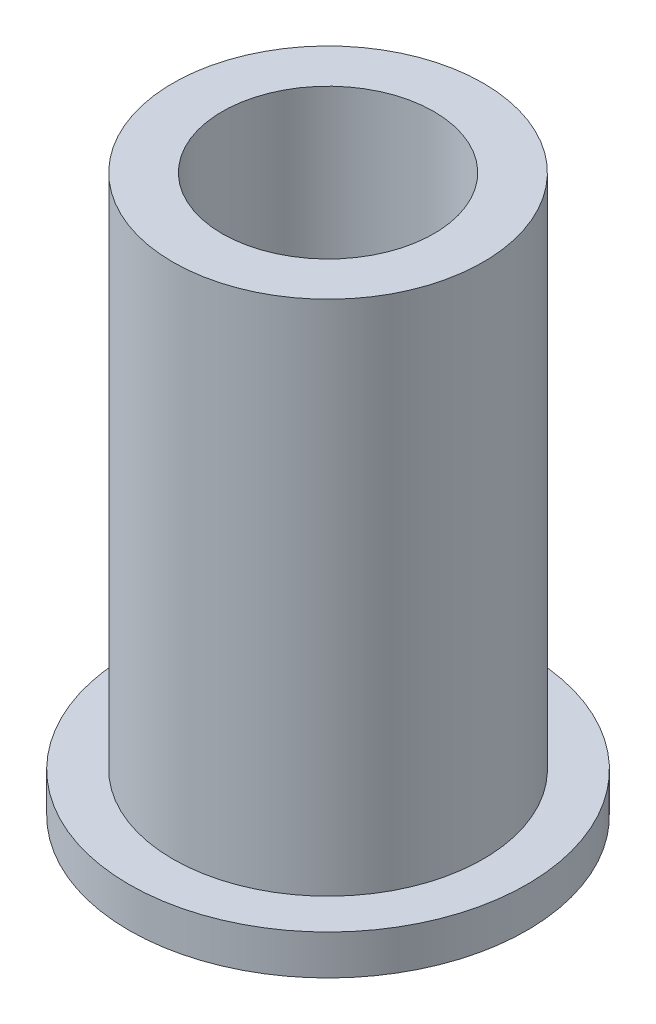
ISO-10303-21;
HEADER;
FILE_DESCRIPTION(('STEP AP214'),'2;1');
FILE_NAME('part.step','',(''),(''),'','','');
FILE_SCHEMA(('AUTOMOTIVE_DESIGN { 1 0 10303 214 1 1 1 1 }'));
ENDSEC;
DATA;
#1=APPLICATION_CONTEXT('core data for automotive mechanical design processes');
#2=APPLICATION_PROTOCOL_DEFINITION('international standard','automotive_design',2000,#1);
#3=PRODUCT_CONTEXT('',#1,'mechanical');
#4=PRODUCT('Part','Part','',(#3));
#5=PRODUCT_RELATED_PRODUCT_CATEGORY('part','',(#4));
#6=PRODUCT_DEFINITION_FORMATION('','',#4);
#7=PRODUCT_DEFINITION_CONTEXT('part definition',#1,'design');
#8=PRODUCT_DEFINITION('design','',#6,#7);
#9=PRODUCT_DEFINITION_SHAPE('','',#8);
#10=(LENGTH_UNIT() NAMED_UNIT(*) SI_UNIT(.MILLI.,.METRE.));
#11=(NAMED_UNIT(*) PLANE_ANGLE_UNIT() SI_UNIT($,.RADIAN.));
#12=(NAMED_UNIT(*) SI_UNIT($,.STERADIAN.) SOLID_ANGLE_UNIT());
#13=UNCERTAINTY_MEASURE_WITH_UNIT(LENGTH_MEASURE(1.E-05),#10,'distance_accuracy_value','');
#14=(GEOMETRIC_REPRESENTATION_CONTEXT(3) GLOBAL_UNCERTAINTY_ASSIGNED_CONTEXT((#13)) GLOBAL_UNIT_ASSIGNED_CONTEXT((#10,
#11,#12)) REPRESENTATION_CONTEXT('',''));
#15=CARTESIAN_POINT('',(0.,0.,0.));
#16=DIRECTION('',(0.,0.,1.));
#17=DIRECTION('',(1.,0.,0.));
#18=AXIS2_PLACEMENT_3D('',#15,#16,#17);
#19=CARTESIAN_POINT('',(0.,1.27,0.));
#20=DIRECTION('',(0.,-1.,0.));
#21=DIRECTION('',(0.,0.,-1.));
#22=AXIS2_PLACEMENT_3D('',#19,#20,#21);
#23=CYLINDRICAL_SURFACE('',#22,6.35);
#24=CARTESIAN_POINT('',(0.,1.27,0.));
#25=DIRECTION('',(0.,1.,0.));
#26=DIRECTION('',(0.,0.,1.));
#27=AXIS2_PLACEMENT_3D('',#24,#25,#26);
#28=CIRCLE('',#27,6.35);
#29=CARTESIAN_POINT('',(0.,1.27,6.35));
#30=VERTEX_POINT('',#29);
#31=EDGE_CURVE('E10',#30,#30,#28,.T.);
#32=ORIENTED_EDGE('',*,*,#31,.F.);
#33=EDGE_LOOP('',(#32));
#34=FACE_BOUND('',#33,.T.);
#35=CARTESIAN_POINT('',(0.,0.,0.));
#36=DIRECTION('',(0.,1.,0.));
#37=DIRECTION('',(0.,0.,1.));
#38=AXIS2_PLACEMENT_3D('',#35,#36,#37);
#39=CIRCLE('',#38,6.35);
#40=CARTESIAN_POINT('',(0.,0.,6.35));
#41=VERTEX_POINT('',#40);
#42=EDGE_CURVE('E40',#41,#41,#39,.T.);
#43=ORIENTED_EDGE('',*,*,#42,.T.);
#44=EDGE_LOOP('',(#43));
#45=FACE_BOUND('',#44,.T.);
#46=ADVANCED_FACE('F37',(#34,#45),#23,.T.);
#47=CARTESIAN_POINT('',(0.,1.27,0.));
#48=DIRECTION('',(0.,1.,0.));
#49=DIRECTION('',(0.,0.,1.));
#50=AXIS2_PLACEMENT_3D('',#47,#48,#49);
#51=PLANE('',#50);
#52=CARTESIAN_POINT('',(0.,1.27,0.));
#53=DIRECTION('',(0.,1.,0.));
#54=DIRECTION('',(0.,0.,1.));
#55=AXIS2_PLACEMENT_3D('',#52,#53,#54);
#56=CIRCLE('',#55,4.95);
#57=CARTESIAN_POINT('',(0.,1.27,4.95));
#58=VERTEX_POINT('',#57);
#59=EDGE_CURVE('E51',#58,#58,#56,.T.);
#60=ORIENTED_EDGE('',*,*,#59,.F.);
#61=EDGE_LOOP('',(#60));
#62=FACE_BOUND('',#61,.T.);
#63=ORIENTED_EDGE('',*,*,#31,.T.);
#64=EDGE_LOOP('',(#63));
#65=FACE_BOUND('',#64,.T.);
#66=ADVANCED_FACE('F83',(#62,#65),#51,.T.);
#67=CARTESIAN_POINT('',(0.,0.,0.));
#68=DIRECTION('',(0.,1.,0.));
#69=DIRECTION('',(0.,0.,1.));
#70=AXIS2_PLACEMENT_3D('',#67,#68,#69);
#71=PLANE('',#70);
#72=CARTESIAN_POINT('',(0.,0.,0.));
#73=DIRECTION('',(0.,1.,0.));
#74=DIRECTION('',(0.,0.,1.));
#75=AXIS2_PLACEMENT_3D('',#72,#73,#74);
#76=CIRCLE('',#75,3.3782);
#77=CARTESIAN_POINT('',(0.,0.,3.3782));
#78=VERTEX_POINT('',#77);
#79=EDGE_CURVE('E62',#78,#78,#76,.T.);
#80=ORIENTED_EDGE('',*,*,#79,.T.);
#81=EDGE_LOOP('',(#80));
#82=FACE_BOUND('',#81,.T.);
#83=ORIENTED_EDGE('',*,*,#42,.F.);
#84=EDGE_LOOP('',(#83));
#85=FACE_BOUND('',#84,.T.);
#86=ADVANCED_FACE('F67',(#82,#85),#71,.F.);
#87=CARTESIAN_POINT('',(0.,17.76959986,0.));
#88=DIRECTION('',(0.,1.,0.));
#89=DIRECTION('',(0.,0.,1.));
#90=AXIS2_PLACEMENT_3D('',#87,#88,#89);
#91=PLANE('',#90);
#92=CARTESIAN_POINT('',(0.,17.76959986,0.));
#93=DIRECTION('',(0.,1.,0.));
#94=DIRECTION('',(0.,0.,1.));
#95=AXIS2_PLACEMENT_3D('',#92,#93,#94);
#96=CIRCLE('',#95,4.95);
#97=CARTESIAN_POINT('',(0.,17.76959986,4.95));
#98=VERTEX_POINT('',#97);
#99=EDGE_CURVE('E49',#98,#98,#96,.T.);
#100=ORIENTED_EDGE('',*,*,#99,.T.);
#101=EDGE_LOOP('',(#100));
#102=FACE_BOUND('',#101,.T.);
#103=CARTESIAN_POINT('',(0.,17.76959986,0.));
#104=DIRECTION('',(0.,1.,0.));
#105=DIRECTION('',(0.,0.,1.));
#106=AXIS2_PLACEMENT_3D('',#103,#104,#105);
#107=CIRCLE('',#106,3.3782);
#108=CARTESIAN_POINT('',(0.,17.76959986,3.3782));
#109=VERTEX_POINT('',#108);
#110=EDGE_CURVE('E55',#109,#109,#107,.T.);
#111=ORIENTED_EDGE('',*,*,#110,.F.);
#112=EDGE_LOOP('',(#111));
#113=FACE_BOUND('',#112,.T.);
#114=ADVANCED_FACE('F78',(#102,#113),#91,.T.);
#115=CARTESIAN_POINT('',(0.,17.76959986,0.));
#116=DIRECTION('',(0.,-1.,0.));
#117=DIRECTION('',(0.,0.,-1.));
#118=AXIS2_PLACEMENT_3D('',#115,#116,#117);
#119=CYLINDRICAL_SURFACE('',#118,4.95);
#120=ORIENTED_EDGE('',*,*,#99,.F.);
#121=EDGE_LOOP('',(#120));
#122=FACE_BOUND('',#121,.T.);
#123=ORIENTED_EDGE('',*,*,#59,.T.);
#124=EDGE_LOOP('',(#123));
#125=FACE_BOUND('',#124,.T.);
#126=ADVANCED_FACE('F72',(#122,#125),#119,.T.);
#127=CARTESIAN_POINT('',(0.,17.76959986,0.));
#128=DIRECTION('',(0.,-1.,0.));
#129=DIRECTION('',(0.,0.,-1.));
#130=AXIS2_PLACEMENT_3D('',#127,#128,#129);
#131=CYLINDRICAL_SURFACE('',#130,3.3782);
#132=ORIENTED_EDGE('',*,*,#110,.T.);
#133=EDGE_LOOP('',(#132));
#134=FACE_BOUND('',#133,.T.);
#135=ORIENTED_EDGE('',*,*,#79,.F.);
#136=EDGE_LOOP('',(#135));
#137=FACE_BOUND('',#136,.T.);
#138=ADVANCED_FACE('F70',(#134,#137),#131,.F.);
#139=CLOSED_SHELL('',(#46,#66,#86,#114,#126,#138));
#140=MANIFOLD_SOLID_BREP('B2',#139);
#141=ADVANCED_BREP_SHAPE_REPRESENTATION('',(#18,#140),#14);
#142=SHAPE_DEFINITION_REPRESENTATION(#9,#141);
ENDSEC;
END-ISO-10303-21;
